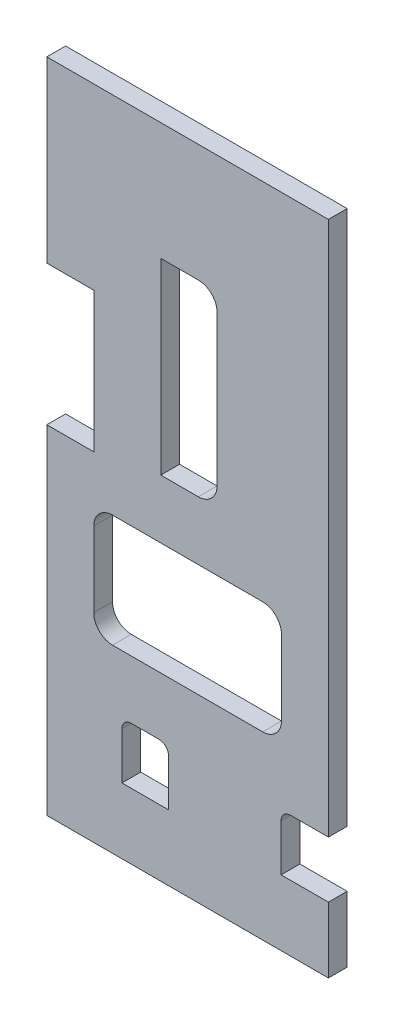
ISO-10303-21;
HEADER;
FILE_DESCRIPTION(('STEP AP214'),'2;1');
FILE_NAME('part.step','',(''),(''),'','','');
FILE_SCHEMA(('AUTOMOTIVE_DESIGN { 1 0 10303 214 1 1 1 1 }'));
ENDSEC;
DATA;
#1=APPLICATION_CONTEXT('core data for automotive mechanical design processes');
#2=APPLICATION_PROTOCOL_DEFINITION('international standard','automotive_design',2000,#1);
#3=PRODUCT_CONTEXT('',#1,'mechanical');
#4=PRODUCT('Part','Part','',(#3));
#5=PRODUCT_RELATED_PRODUCT_CATEGORY('part','',(#4));
#6=PRODUCT_DEFINITION_FORMATION('','',#4);
#7=PRODUCT_DEFINITION_CONTEXT('part definition',#1,'design');
#8=PRODUCT_DEFINITION('design','',#6,#7);
#9=PRODUCT_DEFINITION_SHAPE('','',#8);
#10=(LENGTH_UNIT() NAMED_UNIT(*) SI_UNIT(.MILLI.,.METRE.));
#11=(NAMED_UNIT(*) PLANE_ANGLE_UNIT() SI_UNIT($,.RADIAN.));
#12=(NAMED_UNIT(*) SI_UNIT($,.STERADIAN.) SOLID_ANGLE_UNIT());
#13=UNCERTAINTY_MEASURE_WITH_UNIT(LENGTH_MEASURE(1.E-05),#10,'distance_accuracy_value','');
#14=(GEOMETRIC_REPRESENTATION_CONTEXT(3) GLOBAL_UNCERTAINTY_ASSIGNED_CONTEXT((#13)) GLOBAL_UNIT_ASSIGNED_CONTEXT((#10,
#11,#12)) REPRESENTATION_CONTEXT('',''));
#15=CARTESIAN_POINT('',(0.,0.,0.));
#16=DIRECTION('',(0.,0.,1.));
#17=DIRECTION('',(1.,0.,0.));
#18=AXIS2_PLACEMENT_3D('',#15,#16,#17);
#19=CARTESIAN_POINT('',(95.25,0.,6.35));
#20=DIRECTION('',(-1.,0.,0.));
#21=DIRECTION('',(0.,0.,1.));
#22=AXIS2_PLACEMENT_3D('',#19,#20,#21);
#23=PLANE('',#22);
#24=DIRECTION('',(0.,1.,0.));
#25=VECTOR('',#24,1.);
#26=CARTESIAN_POINT('',(95.25,0.,6.35));
#27=LINE('',#26,#25);
#28=CARTESIAN_POINT('',(95.25,41.2750000000001,6.35));
#29=VERTEX_POINT('',#28);
#30=CARTESIAN_POINT('',(95.25,222.25,6.35));
#31=VERTEX_POINT('',#30);
#32=EDGE_CURVE('E474',#29,#31,#27,.T.);
#33=ORIENTED_EDGE('',*,*,#32,.F.);
#34=DIRECTION('',(0.,0.,-1.));
#35=VECTOR('',#34,1.);
#36=CARTESIAN_POINT('',(95.25,41.2750000000001,6.35));
#37=LINE('',#36,#35);
#38=CARTESIAN_POINT('',(95.25,41.2750000000001,0.));
#39=VERTEX_POINT('',#38);
#40=EDGE_CURVE('E328',#29,#39,#37,.T.);
#41=ORIENTED_EDGE('',*,*,#40,.T.);
#42=DIRECTION('',(0.,1.,0.));
#43=VECTOR('',#42,1.);
#44=CARTESIAN_POINT('',(95.25,0.,0.));
#45=LINE('',#44,#43);
#46=CARTESIAN_POINT('',(95.25,222.25,0.));
#47=VERTEX_POINT('',#46);
#48=EDGE_CURVE('E486',#39,#47,#45,.T.);
#49=ORIENTED_EDGE('',*,*,#48,.T.);
#50=DIRECTION('',(0.,0.,-1.));
#51=VECTOR('',#50,1.);
#52=CARTESIAN_POINT('',(95.25,222.25,6.35));
#53=LINE('',#52,#51);
#54=EDGE_CURVE('E494',#31,#47,#53,.T.);
#55=ORIENTED_EDGE('',*,*,#54,.F.);
#56=EDGE_LOOP('',(#33,#41,#49,#55));
#57=FACE_BOUND('',#56,.T.);
#58=ADVANCED_FACE('F37',(#57),#23,.F.);
#59=CARTESIAN_POINT('',(0.,0.,6.35));
#60=DIRECTION('',(1.,0.,0.));
#61=DIRECTION('',(0.,0.,-1.));
#62=AXIS2_PLACEMENT_3D('',#59,#60,#61);
#63=PLANE('',#62);
#64=DIRECTION('',(0.,-1.,0.));
#65=VECTOR('',#64,1.);
#66=CARTESIAN_POINT('',(0.,0.,0.));
#67=LINE('',#66,#65);
#68=CARTESIAN_POINT('',(0.,222.25,0.));
#69=VERTEX_POINT('',#68);
#70=CARTESIAN_POINT('',(0.,161.812131960124,0.));
#71=VERTEX_POINT('',#70);
#72=EDGE_CURVE('E481',#69,#71,#67,.T.);
#73=ORIENTED_EDGE('',*,*,#72,.T.);
#74=DIRECTION('',(0.,0.,-1.));
#75=VECTOR('',#74,1.);
#76=CARTESIAN_POINT('',(0.,161.812131960124,-4.1785773147932));
#77=LINE('',#76,#75);
#78=CARTESIAN_POINT('',(0.,161.812131960124,6.35));
#79=VERTEX_POINT('',#78);
#80=EDGE_CURVE('E455',#79,#71,#77,.T.);
#81=ORIENTED_EDGE('',*,*,#80,.F.);
#82=DIRECTION('',(0.,-1.,0.));
#83=VECTOR('',#82,1.);
#84=CARTESIAN_POINT('',(0.,0.,6.35));
#85=LINE('',#84,#83);
#86=CARTESIAN_POINT('',(0.,222.25,6.35));
#87=VERTEX_POINT('',#86);
#88=EDGE_CURVE('E468',#87,#79,#85,.T.);
#89=ORIENTED_EDGE('',*,*,#88,.F.);
#90=DIRECTION('',(0.,0.,-1.));
#91=VECTOR('',#90,1.);
#92=CARTESIAN_POINT('',(0.,222.25,6.35));
#93=LINE('',#92,#91);
#94=EDGE_CURVE('E480',#87,#69,#93,.T.);
#95=ORIENTED_EDGE('',*,*,#94,.T.);
#96=EDGE_LOOP('',(#73,#81,#89,#95));
#97=FACE_BOUND('',#96,.T.);
#98=ADVANCED_FACE('F537',(#97),#63,.F.);
#99=CARTESIAN_POINT('',(0.,114.465587535738,6.35));
#100=VERTEX_POINT('',#99);
#101=CARTESIAN_POINT('',(0.,0.,6.35));
#102=VERTEX_POINT('',#101);
#103=EDGE_CURVE('E472',#100,#102,#85,.T.);
#104=ORIENTED_EDGE('',*,*,#103,.F.);
#105=DIRECTION('',(0.,0.,1.));
#106=VECTOR('',#105,1.);
#107=CARTESIAN_POINT('',(0.,114.465587535738,-4.17857731479319));
#108=LINE('',#107,#106);
#109=CARTESIAN_POINT('',(0.,114.465587535738,0.));
#110=VERTEX_POINT('',#109);
#111=EDGE_CURVE('E440',#110,#100,#108,.T.);
#112=ORIENTED_EDGE('',*,*,#111,.F.);
#113=CARTESIAN_POINT('',(0.,0.,0.));
#114=VERTEX_POINT('',#113);
#115=EDGE_CURVE('E467',#110,#114,#67,.T.);
#116=ORIENTED_EDGE('',*,*,#115,.T.);
#117=DIRECTION('',(0.,0.,-1.));
#118=VECTOR('',#117,1.);
#119=CARTESIAN_POINT('',(0.,0.,6.35));
#120=LINE('',#119,#118);
#121=EDGE_CURVE('E500',#102,#114,#120,.T.);
#122=ORIENTED_EDGE('',*,*,#121,.F.);
#123=EDGE_LOOP('',(#104,#112,#116,#122));
#124=FACE_BOUND('',#123,.T.);
#125=ADVANCED_FACE('F39',(#124),#63,.F.);
#126=CARTESIAN_POINT('',(0.,0.,6.35));
#127=DIRECTION('',(0.,1.,0.));
#128=DIRECTION('',(0.,0.,1.));
#129=AXIS2_PLACEMENT_3D('',#126,#127,#128);
#130=PLANE('',#129);
#131=DIRECTION('',(1.,0.,0.));
#132=VECTOR('',#131,1.);
#133=CARTESIAN_POINT('',(0.,0.,0.));
#134=LINE('',#133,#132);
#135=CARTESIAN_POINT('',(95.25,0.,0.));
#136=VERTEX_POINT('',#135);
#137=EDGE_CURVE('E484',#114,#136,#134,.T.);
#138=ORIENTED_EDGE('',*,*,#137,.T.);
#139=DIRECTION('',(0.,0.,-1.));
#140=VECTOR('',#139,1.);
#141=CARTESIAN_POINT('',(95.25,0.,6.35));
#142=LINE('',#141,#140);
#143=CARTESIAN_POINT('',(95.25,0.,6.35));
#144=VERTEX_POINT('',#143);
#145=EDGE_CURVE('E497',#144,#136,#142,.T.);
#146=ORIENTED_EDGE('',*,*,#145,.F.);
#147=DIRECTION('',(1.,0.,0.));
#148=VECTOR('',#147,1.);
#149=CARTESIAN_POINT('',(0.,0.,6.35));
#150=LINE('',#149,#148);
#151=EDGE_CURVE('E471',#102,#144,#150,.T.);
#152=ORIENTED_EDGE('',*,*,#151,.F.);
#153=ORIENTED_EDGE('',*,*,#121,.T.);
#154=EDGE_LOOP('',(#138,#146,#152,#153));
#155=FACE_BOUND('',#154,.T.);
#156=ADVANCED_FACE('F524',(#155),#130,.F.);
#157=CARTESIAN_POINT('',(95.25,22.2250000000001,0.));
#158=VERTEX_POINT('',#157);
#159=EDGE_CURVE('E487',#136,#158,#45,.T.);
#160=ORIENTED_EDGE('',*,*,#159,.T.);
#161=DIRECTION('',(0.,0.,-1.));
#162=VECTOR('',#161,1.);
#163=CARTESIAN_POINT('',(95.25,22.2250000000001,6.35));
#164=LINE('',#163,#162);
#165=CARTESIAN_POINT('',(95.25,22.2250000000001,6.35));
#166=VERTEX_POINT('',#165);
#167=EDGE_CURVE('E318',#166,#158,#164,.T.);
#168=ORIENTED_EDGE('',*,*,#167,.F.);
#169=EDGE_CURVE('E475',#144,#166,#27,.T.);
#170=ORIENTED_EDGE('',*,*,#169,.F.);
#171=ORIENTED_EDGE('',*,*,#145,.T.);
#172=EDGE_LOOP('',(#160,#168,#170,#171));
#173=FACE_BOUND('',#172,.T.);
#174=ADVANCED_FACE('F562',(#173),#23,.F.);
#175=CARTESIAN_POINT('',(0.,222.25,6.35));
#176=DIRECTION('',(0.,-1.,0.));
#177=DIRECTION('',(0.,0.,-1.));
#178=AXIS2_PLACEMENT_3D('',#175,#176,#177);
#179=PLANE('',#178);
#180=DIRECTION('',(-1.,0.,0.));
#181=VECTOR('',#180,1.);
#182=CARTESIAN_POINT('',(0.,222.25,0.));
#183=LINE('',#182,#181);
#184=EDGE_CURVE('E490',#47,#69,#183,.T.);
#185=ORIENTED_EDGE('',*,*,#184,.T.);
#186=ORIENTED_EDGE('',*,*,#94,.F.);
#187=DIRECTION('',(-1.,0.,0.));
#188=VECTOR('',#187,1.);
#189=CARTESIAN_POINT('',(0.,222.25,6.35));
#190=LINE('',#189,#188);
#191=EDGE_CURVE('E478',#31,#87,#190,.T.);
#192=ORIENTED_EDGE('',*,*,#191,.F.);
#193=ORIENTED_EDGE('',*,*,#54,.T.);
#194=EDGE_LOOP('',(#185,#186,#192,#193));
#195=FACE_BOUND('',#194,.T.);
#196=ADVANCED_FACE('F542',(#195),#179,.F.);
#197=CARTESIAN_POINT('',(0.,0.,6.35));
#198=DIRECTION('',(0.,0.,-1.));
#199=DIRECTION('',(-1.,0.,0.));
#200=AXIS2_PLACEMENT_3D('',#197,#198,#199);
#201=PLANE('',#200);
#202=DIRECTION('',(0.,-1.,0.));
#203=VECTOR('',#202,1.);
#204=CARTESIAN_POINT('',(41.148,38.1,6.35));
#205=LINE('',#204,#203);
#206=CARTESIAN_POINT('',(41.148,38.1,6.35));
#207=VERTEX_POINT('',#206);
#208=CARTESIAN_POINT('',(41.148,22.2250000000001,6.35));
#209=VERTEX_POINT('',#208);
#210=EDGE_CURVE('E260',#207,#209,#205,.T.);
#211=ORIENTED_EDGE('',*,*,#210,.T.);
#212=DIRECTION('',(-1.,0.,0.));
#213=VECTOR('',#212,1.);
#214=CARTESIAN_POINT('',(41.148,22.2250000000001,6.35));
#215=LINE('',#214,#213);
#216=CARTESIAN_POINT('',(25.4,22.2250000000001,6.35));
#217=VERTEX_POINT('',#216);
#218=EDGE_CURVE('E254',#209,#217,#215,.T.);
#219=ORIENTED_EDGE('',*,*,#218,.T.);
#220=DIRECTION('',(0.,1.,0.));
#221=VECTOR('',#220,1.);
#222=CARTESIAN_POINT('',(25.4,22.2250000000001,6.35));
#223=LINE('',#222,#221);
#224=CARTESIAN_POINT('',(25.4,38.1,6.35));
#225=VERTEX_POINT('',#224);
#226=EDGE_CURVE('E263',#217,#225,#223,.T.);
#227=ORIENTED_EDGE('',*,*,#226,.T.);
#228=CARTESIAN_POINT('',(28.575,38.1000000000001,6.35));
#229=DIRECTION('',(0.,0.,-1.));
#230=DIRECTION('',(1.,0.,0.));
#231=AXIS2_PLACEMENT_3D('',#228,#229,#230);
#232=CIRCLE('',#231,3.175);
#233=CARTESIAN_POINT('',(28.575,41.2750000000001,6.35));
#234=VERTEX_POINT('',#233);
#235=EDGE_CURVE('E52',#225,#234,#232,.T.);
#236=ORIENTED_EDGE('',*,*,#235,.T.);
#237=DIRECTION('',(1.,0.,0.));
#238=VECTOR('',#237,1.);
#239=CARTESIAN_POINT('',(37.973,41.2750000000001,6.35));
#240=LINE('',#239,#238);
#241=CARTESIAN_POINT('',(37.973,41.2750000000001,6.35));
#242=VERTEX_POINT('',#241);
#243=EDGE_CURVE('E278',#234,#242,#240,.T.);
#244=ORIENTED_EDGE('',*,*,#243,.T.);
#245=CARTESIAN_POINT('',(37.973,38.1000000000001,6.35));
#246=DIRECTION('',(0.,0.,-1.));
#247=DIRECTION('',(-1.,0.,0.));
#248=AXIS2_PLACEMENT_3D('',#245,#246,#247);
#249=CIRCLE('',#248,3.175);
#250=EDGE_CURVE('E281',#242,#207,#249,.T.);
#251=ORIENTED_EDGE('',*,*,#250,.T.);
#252=EDGE_LOOP('',(#211,#219,#227,#236,#244,#251));
#253=FACE_BOUND('',#252,.T.);
#254=DIRECTION('',(-1.,0.,0.));
#255=VECTOR('',#254,1.);
#256=CARTESIAN_POINT('',(73.0249999999999,61.000693086,6.35));
#257=LINE('',#256,#255);
#258=CARTESIAN_POINT('',(73.0249999999999,61.000693086,6.35));
#259=VERTEX_POINT('',#258);
#260=CARTESIAN_POINT('',(22.225,61.000693086,6.35));
#261=VERTEX_POINT('',#260);
#262=EDGE_CURVE('E361',#259,#261,#257,.T.);
#263=ORIENTED_EDGE('',*,*,#262,.T.);
#264=CARTESIAN_POINT('',(22.225,67.350693086,6.35));
#265=DIRECTION('',(0.,0.,-1.));
#266=DIRECTION('',(-1.,0.,0.));
#267=AXIS2_PLACEMENT_3D('',#264,#265,#266);
#268=CIRCLE('',#267,6.35);
#269=CARTESIAN_POINT('',(15.875,67.350693086,6.35));
#270=VERTEX_POINT('',#269);
#271=EDGE_CURVE('E339',#261,#270,#268,.T.);
#272=ORIENTED_EDGE('',*,*,#271,.T.);
#273=DIRECTION('',(0.,1.,0.));
#274=VECTOR('',#273,1.);
#275=CARTESIAN_POINT('',(15.875,92.750693086,6.35));
#276=LINE('',#275,#274);
#277=CARTESIAN_POINT('',(15.875,92.750693086,6.35));
#278=VERTEX_POINT('',#277);
#279=EDGE_CURVE('E342',#270,#278,#276,.T.);
#280=ORIENTED_EDGE('',*,*,#279,.T.);
#281=CARTESIAN_POINT('',(22.225,92.750693086,6.35));
#282=DIRECTION('',(0.,0.,-1.));
#283=DIRECTION('',(1.,0.,0.));
#284=AXIS2_PLACEMENT_3D('',#281,#282,#283);
#285=CIRCLE('',#284,6.35);
#286=CARTESIAN_POINT('',(22.225,99.100693086,6.35));
#287=VERTEX_POINT('',#286);
#288=EDGE_CURVE('E346',#278,#287,#285,.T.);
#289=ORIENTED_EDGE('',*,*,#288,.T.);
#290=DIRECTION('',(1.,0.,0.));
#291=VECTOR('',#290,1.);
#292=CARTESIAN_POINT('',(73.025,99.100693086,6.35));
#293=LINE('',#292,#291);
#294=CARTESIAN_POINT('',(73.025,99.100693086,6.35));
#295=VERTEX_POINT('',#294);
#296=EDGE_CURVE('E349',#287,#295,#293,.T.);
#297=ORIENTED_EDGE('',*,*,#296,.T.);
#298=CARTESIAN_POINT('',(73.025,92.750693086,6.35));
#299=DIRECTION('',(0.,0.,-1.));
#300=DIRECTION('',(-1.,0.,0.));
#301=AXIS2_PLACEMENT_3D('',#298,#299,#300);
#302=CIRCLE('',#301,6.35);
#303=CARTESIAN_POINT('',(79.375,92.750693086,6.35));
#304=VERTEX_POINT('',#303);
#305=EDGE_CURVE('E352',#295,#304,#302,.T.);
#306=ORIENTED_EDGE('',*,*,#305,.T.);
#307=DIRECTION('',(0.,-1.,0.));
#308=VECTOR('',#307,1.);
#309=CARTESIAN_POINT('',(79.375,92.750693086,6.35));
#310=LINE('',#309,#308);
#311=CARTESIAN_POINT('',(79.375,67.350693086,6.35));
#312=VERTEX_POINT('',#311);
#313=EDGE_CURVE('E355',#304,#312,#310,.T.);
#314=ORIENTED_EDGE('',*,*,#313,.T.);
#315=CARTESIAN_POINT('',(73.025,67.350693086,6.35));
#316=DIRECTION('',(0.,0.,-1.));
#317=DIRECTION('',(-1.,0.,0.));
#318=AXIS2_PLACEMENT_3D('',#315,#316,#317);
#319=CIRCLE('',#318,6.35);
#320=EDGE_CURVE('E358',#312,#259,#319,.T.);
#321=ORIENTED_EDGE('',*,*,#320,.T.);
#322=EDGE_LOOP('',(#263,#272,#280,#289,#297,#306,#314,#321));
#323=FACE_BOUND('',#322,.T.);
#324=DIRECTION('',(-1.,0.,0.));
#325=VECTOR('',#324,1.);
#326=CARTESIAN_POINT('',(51.2500000000001,118.983066432882,6.35));
#327=LINE('',#326,#325);
#328=CARTESIAN_POINT('',(51.2500000000001,118.983066432882,6.35));
#329=VERTEX_POINT('',#328);
#330=CARTESIAN_POINT('',(38.5500000000001,118.983066432882,6.35));
#331=VERTEX_POINT('',#330);
#332=EDGE_CURVE('E419',#329,#331,#327,.T.);
#333=ORIENTED_EDGE('',*,*,#332,.T.);
#334=DIRECTION('',(0.,1.,0.));
#335=VECTOR('',#334,1.);
#336=CARTESIAN_POINT('',(38.5500000000001,182.483066432881,6.35));
#337=LINE('',#336,#335);
#338=CARTESIAN_POINT('',(38.5500000000001,182.483066432881,6.35));
#339=VERTEX_POINT('',#338);
#340=EDGE_CURVE('E403',#331,#339,#337,.T.);
#341=ORIENTED_EDGE('',*,*,#340,.T.);
#342=DIRECTION('',(1.,0.,0.));
#343=VECTOR('',#342,1.);
#344=CARTESIAN_POINT('',(51.2500000000001,182.483066432882,6.35));
#345=LINE('',#344,#343);
#346=CARTESIAN_POINT('',(51.2500000000001,182.483066432882,6.35));
#347=VERTEX_POINT('',#346);
#348=EDGE_CURVE('E406',#339,#347,#345,.T.);
#349=ORIENTED_EDGE('',*,*,#348,.T.);
#350=CARTESIAN_POINT('',(51.2500000000001,176.133066432882,6.35));
#351=DIRECTION('',(0.,0.,-1.));
#352=DIRECTION('',(-1.,0.,0.));
#353=AXIS2_PLACEMENT_3D('',#350,#351,#352);
#354=CIRCLE('',#353,6.35);
#355=CARTESIAN_POINT('',(57.6000000000002,176.133066432882,6.35));
#356=VERTEX_POINT('',#355);
#357=EDGE_CURVE('E410',#347,#356,#354,.T.);
#358=ORIENTED_EDGE('',*,*,#357,.T.);
#359=DIRECTION('',(0.,-1.,0.));
#360=VECTOR('',#359,1.);
#361=CARTESIAN_POINT('',(57.6000000000002,176.133066432882,6.35));
#362=LINE('',#361,#360);
#363=CARTESIAN_POINT('',(57.6000000000001,125.333066432881,6.35));
#364=VERTEX_POINT('',#363);
#365=EDGE_CURVE('E413',#356,#364,#362,.T.);
#366=ORIENTED_EDGE('',*,*,#365,.T.);
#367=CARTESIAN_POINT('',(51.2500000000001,125.333066432881,6.35));
#368=DIRECTION('',(0.,0.,-1.));
#369=DIRECTION('',(-1.,0.,0.));
#370=AXIS2_PLACEMENT_3D('',#367,#368,#369);
#371=CIRCLE('',#370,6.35);
#372=EDGE_CURVE('E416',#364,#329,#371,.T.);
#373=ORIENTED_EDGE('',*,*,#372,.T.);
#374=EDGE_LOOP('',(#333,#341,#349,#358,#366,#373));
#375=FACE_BOUND('',#374,.T.);
#376=CARTESIAN_POINT('',(82.423,38.1000000000001,6.35));
#377=DIRECTION('',(0.,0.,-1.));
#378=DIRECTION('',(1.,0.,0.));
#379=AXIS2_PLACEMENT_3D('',#376,#377,#378);
#380=CIRCLE('',#379,3.175);
#381=CARTESIAN_POINT('',(79.248,38.1,6.35));
#382=VERTEX_POINT('',#381);
#383=CARTESIAN_POINT('',(82.423,41.2750000000001,6.35));
#384=VERTEX_POINT('',#383);
#385=EDGE_CURVE('E312',#382,#384,#380,.T.);
#386=ORIENTED_EDGE('',*,*,#385,.T.);
#387=DIRECTION('',(1.,0.,0.));
#388=VECTOR('',#387,1.);
#389=CARTESIAN_POINT('',(95.25,41.2750000000001,6.35));
#390=LINE('',#389,#388);
#391=EDGE_CURVE('E315',#384,#29,#390,.T.);
#392=ORIENTED_EDGE('',*,*,#391,.T.);
#393=ORIENTED_EDGE('',*,*,#32,.T.);
#394=ORIENTED_EDGE('',*,*,#191,.T.);
#395=ORIENTED_EDGE('',*,*,#88,.T.);
#396=DIRECTION('',(1.,0.,0.));
#397=VECTOR('',#396,1.);
#398=CARTESIAN_POINT('',(0.,161.812131960124,6.35));
#399=LINE('',#398,#397);
#400=CARTESIAN_POINT('',(15.875,161.812131960124,6.35));
#401=VERTEX_POINT('',#400);
#402=EDGE_CURVE('E464',#79,#401,#399,.T.);
#403=ORIENTED_EDGE('',*,*,#402,.T.);
#404=DIRECTION('',(0.,1.,0.));
#405=VECTOR('',#404,1.);
#406=CARTESIAN_POINT('',(15.875,0.,6.35));
#407=LINE('',#406,#405);
#408=CARTESIAN_POINT('',(15.875,114.465587535738,6.35));
#409=VERTEX_POINT('',#408);
#410=EDGE_CURVE('E457',#409,#401,#407,.T.);
#411=ORIENTED_EDGE('',*,*,#410,.F.);
#412=DIRECTION('',(-1.,0.,0.));
#413=VECTOR('',#412,1.);
#414=CARTESIAN_POINT('',(0.,114.465587535738,6.35));
#415=LINE('',#414,#413);
#416=EDGE_CURVE('E461',#409,#100,#415,.T.);
#417=ORIENTED_EDGE('',*,*,#416,.T.);
#418=ORIENTED_EDGE('',*,*,#103,.T.);
#419=ORIENTED_EDGE('',*,*,#151,.T.);
#420=ORIENTED_EDGE('',*,*,#169,.T.);
#421=DIRECTION('',(-1.,0.,0.));
#422=VECTOR('',#421,1.);
#423=CARTESIAN_POINT('',(95.25,22.2250000000001,6.35));
#424=LINE('',#423,#422);
#425=CARTESIAN_POINT('',(79.248,22.2250000000001,6.35));
#426=VERTEX_POINT('',#425);
#427=EDGE_CURVE('E305',#166,#426,#424,.T.);
#428=ORIENTED_EDGE('',*,*,#427,.T.);
#429=DIRECTION('',(0.,1.,0.));
#430=VECTOR('',#429,1.);
#431=CARTESIAN_POINT('',(79.248,38.1,6.35));
#432=LINE('',#431,#430);
#433=EDGE_CURVE('E308',#426,#382,#432,.T.);
#434=ORIENTED_EDGE('',*,*,#433,.T.);
#435=EDGE_LOOP('',(#386,#392,#393,#394,#395,#403,#411,#417,#418,#419,#420,#428,#434));
#436=FACE_BOUND('',#435,.T.);
#437=ADVANCED_FACE('F267',(#253,#323,#375,#436),#201,.F.);
#438=CARTESIAN_POINT('',(0.,0.,0.));
#439=DIRECTION('',(0.,0.,-1.));
#440=DIRECTION('',(-1.,0.,0.));
#441=AXIS2_PLACEMENT_3D('',#438,#439,#440);
#442=PLANE('',#441);
#443=DIRECTION('',(-1.,0.,0.));
#444=VECTOR('',#443,1.);
#445=CARTESIAN_POINT('',(41.148,22.2250000000001,0.));
#446=LINE('',#445,#444);
#447=CARTESIAN_POINT('',(41.148,22.2250000000001,0.));
#448=VERTEX_POINT('',#447);
#449=CARTESIAN_POINT('',(25.4,22.2250000000001,0.));
#450=VERTEX_POINT('',#449);
#451=EDGE_CURVE('E60',#448,#450,#446,.T.);
#452=ORIENTED_EDGE('',*,*,#451,.F.);
#453=DIRECTION('',(0.,-1.,0.));
#454=VECTOR('',#453,1.);
#455=CARTESIAN_POINT('',(41.148,38.1,0.));
#456=LINE('',#455,#454);
#457=CARTESIAN_POINT('',(41.148,38.1,0.));
#458=VERTEX_POINT('',#457);
#459=EDGE_CURVE('E271',#458,#448,#456,.T.);
#460=ORIENTED_EDGE('',*,*,#459,.F.);
#461=CARTESIAN_POINT('',(37.973,38.1000000000001,0.));
#462=DIRECTION('',(0.,0.,-1.));
#463=DIRECTION('',(-1.,0.,0.));
#464=AXIS2_PLACEMENT_3D('',#461,#462,#463);
#465=CIRCLE('',#464,3.175);
#466=CARTESIAN_POINT('',(37.973,41.2750000000001,0.));
#467=VERTEX_POINT('',#466);
#468=EDGE_CURVE('E274',#467,#458,#465,.T.);
#469=ORIENTED_EDGE('',*,*,#468,.F.);
#470=DIRECTION('',(1.,0.,0.));
#471=VECTOR('',#470,1.);
#472=CARTESIAN_POINT('',(37.973,41.2750000000001,0.));
#473=LINE('',#472,#471);
#474=CARTESIAN_POINT('',(28.575,41.2750000000001,0.));
#475=VERTEX_POINT('',#474);
#476=EDGE_CURVE('E290',#475,#467,#473,.T.);
#477=ORIENTED_EDGE('',*,*,#476,.F.);
#478=CARTESIAN_POINT('',(28.575,38.1000000000001,0.));
#479=DIRECTION('',(0.,0.,-1.));
#480=DIRECTION('',(1.,0.,0.));
#481=AXIS2_PLACEMENT_3D('',#478,#479,#480);
#482=CIRCLE('',#481,3.175);
#483=CARTESIAN_POINT('',(25.4,38.1,0.));
#484=VERTEX_POINT('',#483);
#485=EDGE_CURVE('E287',#484,#475,#482,.T.);
#486=ORIENTED_EDGE('',*,*,#485,.F.);
#487=DIRECTION('',(0.,1.,0.));
#488=VECTOR('',#487,1.);
#489=CARTESIAN_POINT('',(25.4,22.2250000000001,0.));
#490=LINE('',#489,#488);
#491=EDGE_CURVE('E285',#450,#484,#490,.T.);
#492=ORIENTED_EDGE('',*,*,#491,.F.);
#493=EDGE_LOOP('',(#452,#460,#469,#477,#486,#492));
#494=FACE_BOUND('',#493,.T.);
#495=DIRECTION('',(1.,0.,0.));
#496=VECTOR('',#495,1.);
#497=CARTESIAN_POINT('',(95.25,41.2750000000001,0.));
#498=LINE('',#497,#496);
#499=CARTESIAN_POINT('',(82.423,41.2750000000001,0.));
#500=VERTEX_POINT('',#499);
#501=EDGE_CURVE('E309',#500,#39,#498,.T.);
#502=ORIENTED_EDGE('',*,*,#501,.F.);
#503=CARTESIAN_POINT('',(82.423,38.1000000000001,0.));
#504=DIRECTION('',(0.,0.,-1.));
#505=DIRECTION('',(1.,0.,0.));
#506=AXIS2_PLACEMENT_3D('',#503,#504,#505);
#507=CIRCLE('',#506,3.175);
#508=CARTESIAN_POINT('',(79.248,38.1,0.));
#509=VERTEX_POINT('',#508);
#510=EDGE_CURVE('E324',#509,#500,#507,.T.);
#511=ORIENTED_EDGE('',*,*,#510,.F.);
#512=DIRECTION('',(0.,1.,0.));
#513=VECTOR('',#512,1.);
#514=CARTESIAN_POINT('',(79.248,38.1,0.));
#515=LINE('',#514,#513);
#516=CARTESIAN_POINT('',(79.248,22.2250000000001,0.));
#517=VERTEX_POINT('',#516);
#518=EDGE_CURVE('E321',#517,#509,#515,.T.);
#519=ORIENTED_EDGE('',*,*,#518,.F.);
#520=DIRECTION('',(-1.,0.,0.));
#521=VECTOR('',#520,1.);
#522=CARTESIAN_POINT('',(95.25,22.2250000000001,0.));
#523=LINE('',#522,#521);
#524=EDGE_CURVE('E297',#158,#517,#523,.T.);
#525=ORIENTED_EDGE('',*,*,#524,.F.);
#526=ORIENTED_EDGE('',*,*,#159,.F.);
#527=ORIENTED_EDGE('',*,*,#137,.F.);
#528=ORIENTED_EDGE('',*,*,#115,.F.);
#529=DIRECTION('',(-1.,0.,0.));
#530=VECTOR('',#529,1.);
#531=CARTESIAN_POINT('',(0.,114.465587535738,0.));
#532=LINE('',#531,#530);
#533=CARTESIAN_POINT('',(15.875,114.465587535738,0.));
#534=VERTEX_POINT('',#533);
#535=EDGE_CURVE('E45',#534,#110,#532,.T.);
#536=ORIENTED_EDGE('',*,*,#535,.F.);
#537=DIRECTION('',(0.,1.,0.));
#538=VECTOR('',#537,1.);
#539=CARTESIAN_POINT('',(15.875,0.,0.));
#540=LINE('',#539,#538);
#541=CARTESIAN_POINT('',(15.875,161.812131960124,0.));
#542=VERTEX_POINT('',#541);
#543=EDGE_CURVE('E503',#534,#542,#540,.T.);
#544=ORIENTED_EDGE('',*,*,#543,.T.);
#545=DIRECTION('',(1.,0.,0.));
#546=VECTOR('',#545,1.);
#547=CARTESIAN_POINT('',(0.,161.812131960124,0.));
#548=LINE('',#547,#546);
#549=EDGE_CURVE('E11',#71,#542,#548,.T.);
#550=ORIENTED_EDGE('',*,*,#549,.F.);
#551=ORIENTED_EDGE('',*,*,#72,.F.);
#552=ORIENTED_EDGE('',*,*,#184,.F.);
#553=ORIENTED_EDGE('',*,*,#48,.F.);
#554=EDGE_LOOP('',(#502,#511,#519,#525,#526,#527,#528,#536,#544,#550,#551,#552,#553));
#555=FACE_BOUND('',#554,.T.);
#556=CARTESIAN_POINT('',(22.225,67.350693086,0.));
#557=DIRECTION('',(0.,0.,-1.));
#558=DIRECTION('',(-1.,0.,0.));
#559=AXIS2_PLACEMENT_3D('',#556,#557,#558);
#560=CIRCLE('',#559,6.35);
#561=CARTESIAN_POINT('',(22.225,61.000693086,0.));
#562=VERTEX_POINT('',#561);
#563=CARTESIAN_POINT('',(15.875,67.350693086,0.));
#564=VERTEX_POINT('',#563);
#565=EDGE_CURVE('E331',#562,#564,#560,.T.);
#566=ORIENTED_EDGE('',*,*,#565,.F.);
#567=DIRECTION('',(-1.,0.,0.));
#568=VECTOR('',#567,1.);
#569=CARTESIAN_POINT('',(73.0249999999999,61.000693086,0.));
#570=LINE('',#569,#568);
#571=CARTESIAN_POINT('',(73.0249999999999,61.000693086,0.));
#572=VERTEX_POINT('',#571);
#573=EDGE_CURVE('E343',#572,#562,#570,.T.);
#574=ORIENTED_EDGE('',*,*,#573,.F.);
#575=CARTESIAN_POINT('',(73.025,67.350693086,0.));
#576=DIRECTION('',(0.,0.,-1.));
#577=DIRECTION('',(-1.,0.,0.));
#578=AXIS2_PLACEMENT_3D('',#575,#576,#577);
#579=CIRCLE('',#578,6.35);
#580=CARTESIAN_POINT('',(79.375,67.350693086,0.));
#581=VERTEX_POINT('',#580);
#582=EDGE_CURVE('E381',#581,#572,#579,.T.);
#583=ORIENTED_EDGE('',*,*,#582,.F.);
#584=DIRECTION('',(0.,-1.,0.));
#585=VECTOR('',#584,1.);
#586=CARTESIAN_POINT('',(79.375,92.750693086,0.));
#587=LINE('',#586,#585);
#588=CARTESIAN_POINT('',(79.375,92.750693086,0.));
#589=VERTEX_POINT('',#588);
#590=EDGE_CURVE('E378',#589,#581,#587,.T.);
#591=ORIENTED_EDGE('',*,*,#590,.F.);
#592=CARTESIAN_POINT('',(73.025,92.750693086,0.));
#593=DIRECTION('',(0.,0.,-1.));
#594=DIRECTION('',(-1.,0.,0.));
#595=AXIS2_PLACEMENT_3D('',#592,#593,#594);
#596=CIRCLE('',#595,6.35);
#597=CARTESIAN_POINT('',(73.025,99.100693086,0.));
#598=VERTEX_POINT('',#597);
#599=EDGE_CURVE('E375',#598,#589,#596,.T.);
#600=ORIENTED_EDGE('',*,*,#599,.F.);
#601=DIRECTION('',(1.,0.,0.));
#602=VECTOR('',#601,1.);
#603=CARTESIAN_POINT('',(73.025,99.100693086,0.));
#604=LINE('',#603,#602);
#605=CARTESIAN_POINT('',(22.225,99.100693086,0.));
#606=VERTEX_POINT('',#605);
#607=EDGE_CURVE('E372',#606,#598,#604,.T.);
#608=ORIENTED_EDGE('',*,*,#607,.F.);
#609=CARTESIAN_POINT('',(22.225,92.750693086,0.));
#610=DIRECTION('',(0.,0.,-1.));
#611=DIRECTION('',(1.,0.,0.));
#612=AXIS2_PLACEMENT_3D('',#609,#610,#611);
#613=CIRCLE('',#612,6.35);
#614=CARTESIAN_POINT('',(15.875,92.750693086,0.));
#615=VERTEX_POINT('',#614);
#616=EDGE_CURVE('E369',#615,#606,#613,.T.);
#617=ORIENTED_EDGE('',*,*,#616,.F.);
#618=DIRECTION('',(0.,1.,0.));
#619=VECTOR('',#618,1.);
#620=CARTESIAN_POINT('',(15.875,92.750693086,0.));
#621=LINE('',#620,#619);
#622=EDGE_CURVE('E366',#564,#615,#621,.T.);
#623=ORIENTED_EDGE('',*,*,#622,.F.);
#624=EDGE_LOOP('',(#566,#574,#583,#591,#600,#608,#617,#623));
#625=FACE_BOUND('',#624,.T.);
#626=DIRECTION('',(0.,1.,0.));
#627=VECTOR('',#626,1.);
#628=CARTESIAN_POINT('',(38.5500000000001,182.483066432881,0.));
#629=LINE('',#628,#627);
#630=CARTESIAN_POINT('',(38.5500000000001,118.983066432882,0.));
#631=VERTEX_POINT('',#630);
#632=CARTESIAN_POINT('',(38.5500000000001,182.483066432881,0.));
#633=VERTEX_POINT('',#632);
#634=EDGE_CURVE('E388',#631,#633,#629,.T.);
#635=ORIENTED_EDGE('',*,*,#634,.F.);
#636=DIRECTION('',(-1.,0.,0.));
#637=VECTOR('',#636,1.);
#638=CARTESIAN_POINT('',(51.2500000000001,118.983066432882,0.));
#639=LINE('',#638,#637);
#640=CARTESIAN_POINT('',(51.2500000000001,118.983066432882,0.));
#641=VERTEX_POINT('',#640);
#642=EDGE_CURVE('E407',#641,#631,#639,.T.);
#643=ORIENTED_EDGE('',*,*,#642,.F.);
#644=CARTESIAN_POINT('',(51.2500000000001,125.333066432881,0.));
#645=DIRECTION('',(0.,0.,-1.));
#646=DIRECTION('',(-1.,0.,0.));
#647=AXIS2_PLACEMENT_3D('',#644,#645,#646);
#648=CIRCLE('',#647,6.35);
#649=CARTESIAN_POINT('',(57.6000000000001,125.333066432881,0.));
#650=VERTEX_POINT('',#649);
#651=EDGE_CURVE('E433',#650,#641,#648,.T.);
#652=ORIENTED_EDGE('',*,*,#651,.F.);
#653=DIRECTION('',(0.,-1.,0.));
#654=VECTOR('',#653,1.);
#655=CARTESIAN_POINT('',(57.6000000000002,176.133066432882,0.));
#656=LINE('',#655,#654);
#657=CARTESIAN_POINT('',(57.6000000000002,176.133066432882,0.));
#658=VERTEX_POINT('',#657);
#659=EDGE_CURVE('E430',#658,#650,#656,.T.);
#660=ORIENTED_EDGE('',*,*,#659,.F.);
#661=CARTESIAN_POINT('',(51.2500000000001,176.133066432882,0.));
#662=DIRECTION('',(0.,0.,-1.));
#663=DIRECTION('',(-1.,0.,0.));
#664=AXIS2_PLACEMENT_3D('',#661,#662,#663);
#665=CIRCLE('',#664,6.35);
#666=CARTESIAN_POINT('',(51.2500000000001,182.483066432882,0.));
#667=VERTEX_POINT('',#666);
#668=EDGE_CURVE('E427',#667,#658,#665,.T.);
#669=ORIENTED_EDGE('',*,*,#668,.F.);
#670=DIRECTION('',(1.,0.,0.));
#671=VECTOR('',#670,1.);
#672=CARTESIAN_POINT('',(51.2500000000001,182.483066432882,0.));
#673=LINE('',#672,#671);
#674=EDGE_CURVE('E424',#633,#667,#673,.T.);
#675=ORIENTED_EDGE('',*,*,#674,.F.);
#676=EDGE_LOOP('',(#635,#643,#652,#660,#669,#675));
#677=FACE_BOUND('',#676,.T.);
#678=ADVANCED_FACE('F517',(#494,#555,#625,#677),#442,.T.);
#679=CARTESIAN_POINT('',(15.875,161.812131960124,-4.1785773147932));
#680=DIRECTION('',(0.,1.,0.));
#681=DIRECTION('',(0.,0.,1.));
#682=AXIS2_PLACEMENT_3D('',#679,#680,#681);
#683=PLANE('',#682);
#684=ORIENTED_EDGE('',*,*,#80,.T.);
#685=ORIENTED_EDGE('',*,*,#549,.T.);
#686=DIRECTION('',(0.,0.,-1.));
#687=VECTOR('',#686,1.);
#688=CARTESIAN_POINT('',(15.875,161.812131960124,-4.1785773147932));
#689=LINE('',#688,#687);
#690=EDGE_CURVE('E454',#401,#542,#689,.T.);
#691=ORIENTED_EDGE('',*,*,#690,.F.);
#692=ORIENTED_EDGE('',*,*,#402,.F.);
#693=EDGE_LOOP('',(#684,#685,#691,#692));
#694=FACE_BOUND('',#693,.T.);
#695=ADVANCED_FACE('F585',(#694),#683,.F.);
#696=CARTESIAN_POINT('',(15.875,114.465587535738,-4.17857731479319));
#697=DIRECTION('',(0.,-1.,0.));
#698=DIRECTION('',(0.,0.,-1.));
#699=AXIS2_PLACEMENT_3D('',#696,#697,#698);
#700=PLANE('',#699);
#701=DIRECTION('',(0.,0.,1.));
#702=VECTOR('',#701,1.);
#703=CARTESIAN_POINT('',(15.875,114.465587535738,-4.17857731479319));
#704=LINE('',#703,#702);
#705=EDGE_CURVE('E451',#534,#409,#704,.T.);
#706=ORIENTED_EDGE('',*,*,#705,.F.);
#707=ORIENTED_EDGE('',*,*,#535,.T.);
#708=ORIENTED_EDGE('',*,*,#111,.T.);
#709=ORIENTED_EDGE('',*,*,#416,.F.);
#710=EDGE_LOOP('',(#706,#707,#708,#709));
#711=FACE_BOUND('',#710,.T.);
#712=ADVANCED_FACE('F509',(#711),#700,.F.);
#713=CARTESIAN_POINT('',(15.875,0.,0.));
#714=DIRECTION('',(-1.,0.,0.));
#715=DIRECTION('',(0.,0.,1.));
#716=AXIS2_PLACEMENT_3D('',#713,#714,#715);
#717=PLANE('',#716);
#718=ORIENTED_EDGE('',*,*,#410,.T.);
#719=ORIENTED_EDGE('',*,*,#690,.T.);
#720=ORIENTED_EDGE('',*,*,#543,.F.);
#721=ORIENTED_EDGE('',*,*,#705,.T.);
#722=EDGE_LOOP('',(#718,#719,#720,#721));
#723=FACE_BOUND('',#722,.T.);
#724=ADVANCED_FACE('F529',(#723),#717,.T.);
#725=CARTESIAN_POINT('',(38.5500000000001,182.483066432881,6.35));
#726=DIRECTION('',(-1.,0.,0.));
#727=DIRECTION('',(0.,-1.,0.));
#728=AXIS2_PLACEMENT_3D('',#725,#726,#727);
#729=PLANE('',#728);
#730=ORIENTED_EDGE('',*,*,#634,.T.);
#731=DIRECTION('',(0.,0.,-1.));
#732=VECTOR('',#731,1.);
#733=CARTESIAN_POINT('',(38.5500000000001,182.483066432881,6.35));
#734=LINE('',#733,#732);
#735=EDGE_CURVE('E422',#339,#633,#734,.T.);
#736=ORIENTED_EDGE('',*,*,#735,.F.);
#737=ORIENTED_EDGE('',*,*,#340,.F.);
#738=DIRECTION('',(0.,0.,-1.));
#739=VECTOR('',#738,1.);
#740=CARTESIAN_POINT('',(38.5500000000001,118.983066432882,6.35));
#741=LINE('',#740,#739);
#742=EDGE_CURVE('E438',#331,#631,#741,.T.);
#743=ORIENTED_EDGE('',*,*,#742,.T.);
#744=EDGE_LOOP('',(#730,#736,#737,#743));
#745=FACE_BOUND('',#744,.T.);
#746=ADVANCED_FACE('F607',(#745),#729,.F.);
#747=CARTESIAN_POINT('',(51.2500000000001,118.983066432882,6.35));
#748=DIRECTION('',(0.,-1.,0.));
#749=DIRECTION('',(0.,0.,-1.));
#750=AXIS2_PLACEMENT_3D('',#747,#748,#749);
#751=PLANE('',#750);
#752=ORIENTED_EDGE('',*,*,#642,.T.);
#753=ORIENTED_EDGE('',*,*,#742,.F.);
#754=ORIENTED_EDGE('',*,*,#332,.F.);
#755=DIRECTION('',(0.,0.,-1.));
#756=VECTOR('',#755,1.);
#757=CARTESIAN_POINT('',(51.2500000000001,118.983066432882,6.35));
#758=LINE('',#757,#756);
#759=EDGE_CURVE('E441',#329,#641,#758,.T.);
#760=ORIENTED_EDGE('',*,*,#759,.T.);
#761=EDGE_LOOP('',(#752,#753,#754,#760));
#762=FACE_BOUND('',#761,.T.);
#763=ADVANCED_FACE('F616',(#762),#751,.F.);
#764=CARTESIAN_POINT('',(51.2500000000001,125.333066432881,6.35));
#765=DIRECTION('',(0.,0.,-1.));
#766=DIRECTION('',(-1.,0.,0.));
#767=AXIS2_PLACEMENT_3D('',#764,#765,#766);
#768=CYLINDRICAL_SURFACE('',#767,6.35);
#769=ORIENTED_EDGE('',*,*,#651,.T.);
#770=ORIENTED_EDGE('',*,*,#759,.F.);
#771=ORIENTED_EDGE('',*,*,#372,.F.);
#772=DIRECTION('',(0.,0.,-1.));
#773=VECTOR('',#772,1.);
#774=CARTESIAN_POINT('',(57.6000000000001,125.333066432881,6.35));
#775=LINE('',#774,#773);
#776=EDGE_CURVE('E443',#364,#650,#775,.T.);
#777=ORIENTED_EDGE('',*,*,#776,.T.);
#778=EDGE_LOOP('',(#769,#770,#771,#777));
#779=FACE_BOUND('',#778,.T.);
#780=ADVANCED_FACE('F626',(#779),#768,.F.);
#781=CARTESIAN_POINT('',(57.6000000000002,176.133066432882,6.35));
#782=DIRECTION('',(1.,0.,0.));
#783=DIRECTION('',(0.,0.,-1.));
#784=AXIS2_PLACEMENT_3D('',#781,#782,#783);
#785=PLANE('',#784);
#786=ORIENTED_EDGE('',*,*,#659,.T.);
#787=ORIENTED_EDGE('',*,*,#776,.F.);
#788=ORIENTED_EDGE('',*,*,#365,.F.);
#789=DIRECTION('',(0.,0.,-1.));
#790=VECTOR('',#789,1.);
#791=CARTESIAN_POINT('',(57.6000000000002,176.133066432882,6.35));
#792=LINE('',#791,#790);
#793=EDGE_CURVE('E445',#356,#658,#792,.T.);
#794=ORIENTED_EDGE('',*,*,#793,.T.);
#795=EDGE_LOOP('',(#786,#787,#788,#794));
#796=FACE_BOUND('',#795,.T.);
#797=ADVANCED_FACE('F636',(#796),#785,.F.);
#798=CARTESIAN_POINT('',(51.2500000000001,176.133066432882,6.35));
#799=DIRECTION('',(0.,0.,-1.));
#800=DIRECTION('',(-1.,0.,0.));
#801=AXIS2_PLACEMENT_3D('',#798,#799,#800);
#802=CYLINDRICAL_SURFACE('',#801,6.35);
#803=ORIENTED_EDGE('',*,*,#668,.T.);
#804=ORIENTED_EDGE('',*,*,#793,.F.);
#805=ORIENTED_EDGE('',*,*,#357,.F.);
#806=DIRECTION('',(0.,0.,-1.));
#807=VECTOR('',#806,1.);
#808=CARTESIAN_POINT('',(51.2500000000001,182.483066432882,6.35));
#809=LINE('',#808,#807);
#810=EDGE_CURVE('E447',#347,#667,#809,.T.);
#811=ORIENTED_EDGE('',*,*,#810,.T.);
#812=EDGE_LOOP('',(#803,#804,#805,#811));
#813=FACE_BOUND('',#812,.T.);
#814=ADVANCED_FACE('F646',(#813),#802,.F.);
#815=CARTESIAN_POINT('',(51.2500000000001,182.483066432882,6.35));
#816=DIRECTION('',(0.,1.,0.));
#817=DIRECTION('',(-1.,0.,0.));
#818=AXIS2_PLACEMENT_3D('',#815,#816,#817);
#819=PLANE('',#818);
#820=ORIENTED_EDGE('',*,*,#674,.T.);
#821=ORIENTED_EDGE('',*,*,#810,.F.);
#822=ORIENTED_EDGE('',*,*,#348,.F.);
#823=ORIENTED_EDGE('',*,*,#735,.T.);
#824=EDGE_LOOP('',(#820,#821,#822,#823));
#825=FACE_BOUND('',#824,.T.);
#826=ADVANCED_FACE('F656',(#825),#819,.F.);
#827=CARTESIAN_POINT('',(22.225,67.350693086,6.35));
#828=DIRECTION('',(0.,0.,-1.));
#829=DIRECTION('',(-1.,0.,0.));
#830=AXIS2_PLACEMENT_3D('',#827,#828,#829);
#831=CYLINDRICAL_SURFACE('',#830,6.35);
#832=ORIENTED_EDGE('',*,*,#565,.T.);
#833=DIRECTION('',(0.,0.,-1.));
#834=VECTOR('',#833,1.);
#835=CARTESIAN_POINT('',(15.875,67.350693086,6.35));
#836=LINE('',#835,#834);
#837=EDGE_CURVE('E364',#270,#564,#836,.T.);
#838=ORIENTED_EDGE('',*,*,#837,.F.);
#839=ORIENTED_EDGE('',*,*,#271,.F.);
#840=DIRECTION('',(0.,0.,-1.));
#841=VECTOR('',#840,1.);
#842=CARTESIAN_POINT('',(22.225,61.000693086,6.35));
#843=LINE('',#842,#841);
#844=EDGE_CURVE('E386',#261,#562,#843,.T.);
#845=ORIENTED_EDGE('',*,*,#844,.T.);
#846=EDGE_LOOP('',(#832,#838,#839,#845));
#847=FACE_BOUND('',#846,.T.);
#848=ADVANCED_FACE('F666',(#847),#831,.F.);
#849=CARTESIAN_POINT('',(73.0249999999999,61.000693086,6.35));
#850=DIRECTION('',(0.,-1.,0.));
#851=DIRECTION('',(0.,0.,-1.));
#852=AXIS2_PLACEMENT_3D('',#849,#850,#851);
#853=PLANE('',#852);
#854=ORIENTED_EDGE('',*,*,#573,.T.);
#855=ORIENTED_EDGE('',*,*,#844,.F.);
#856=ORIENTED_EDGE('',*,*,#262,.F.);
#857=DIRECTION('',(0.,0.,-1.));
#858=VECTOR('',#857,1.);
#859=CARTESIAN_POINT('',(73.0249999999999,61.000693086,6.35));
#860=LINE('',#859,#858);
#861=EDGE_CURVE('E389',#259,#572,#860,.T.);
#862=ORIENTED_EDGE('',*,*,#861,.T.);
#863=EDGE_LOOP('',(#854,#855,#856,#862));
#864=FACE_BOUND('',#863,.T.);
#865=ADVANCED_FACE('F676',(#864),#853,.F.);
#866=CARTESIAN_POINT('',(73.025,67.350693086,6.35));
#867=DIRECTION('',(0.,0.,-1.));
#868=DIRECTION('',(-1.,0.,0.));
#869=AXIS2_PLACEMENT_3D('',#866,#867,#868);
#870=CYLINDRICAL_SURFACE('',#869,6.35);
#871=ORIENTED_EDGE('',*,*,#582,.T.);
#872=ORIENTED_EDGE('',*,*,#861,.F.);
#873=ORIENTED_EDGE('',*,*,#320,.F.);
#874=DIRECTION('',(0.,0.,-1.));
#875=VECTOR('',#874,1.);
#876=CARTESIAN_POINT('',(79.375,67.350693086,6.35));
#877=LINE('',#876,#875);
#878=EDGE_CURVE('E391',#312,#581,#877,.T.);
#879=ORIENTED_EDGE('',*,*,#878,.T.);
#880=EDGE_LOOP('',(#871,#872,#873,#879));
#881=FACE_BOUND('',#880,.T.);
#882=ADVANCED_FACE('F686',(#881),#870,.F.);
#883=CARTESIAN_POINT('',(79.375,92.750693086,6.35));
#884=DIRECTION('',(1.,0.,0.));
#885=DIRECTION('',(0.,1.,0.));
#886=AXIS2_PLACEMENT_3D('',#883,#884,#885);
#887=PLANE('',#886);
#888=ORIENTED_EDGE('',*,*,#590,.T.);
#889=ORIENTED_EDGE('',*,*,#878,.F.);
#890=ORIENTED_EDGE('',*,*,#313,.F.);
#891=DIRECTION('',(0.,0.,-1.));
#892=VECTOR('',#891,1.);
#893=CARTESIAN_POINT('',(79.375,92.750693086,6.35));
#894=LINE('',#893,#892);
#895=EDGE_CURVE('E393',#304,#589,#894,.T.);
#896=ORIENTED_EDGE('',*,*,#895,.T.);
#897=EDGE_LOOP('',(#888,#889,#890,#896));
#898=FACE_BOUND('',#897,.T.);
#899=ADVANCED_FACE('F696',(#898),#887,.F.);
#900=CARTESIAN_POINT('',(73.025,92.750693086,6.35));
#901=DIRECTION('',(0.,0.,-1.));
#902=DIRECTION('',(-1.,0.,0.));
#903=AXIS2_PLACEMENT_3D('',#900,#901,#902);
#904=CYLINDRICAL_SURFACE('',#903,6.35);
#905=ORIENTED_EDGE('',*,*,#599,.T.);
#906=ORIENTED_EDGE('',*,*,#895,.F.);
#907=ORIENTED_EDGE('',*,*,#305,.F.);
#908=DIRECTION('',(0.,0.,-1.));
#909=VECTOR('',#908,1.);
#910=CARTESIAN_POINT('',(73.025,99.100693086,6.35));
#911=LINE('',#910,#909);
#912=EDGE_CURVE('E395',#295,#598,#911,.T.);
#913=ORIENTED_EDGE('',*,*,#912,.T.);
#914=EDGE_LOOP('',(#905,#906,#907,#913));
#915=FACE_BOUND('',#914,.T.);
#916=ADVANCED_FACE('F706',(#915),#904,.F.);
#917=CARTESIAN_POINT('',(73.025,99.100693086,6.35));
#918=DIRECTION('',(0.,1.,0.));
#919=DIRECTION('',(0.,0.,1.));
#920=AXIS2_PLACEMENT_3D('',#917,#918,#919);
#921=PLANE('',#920);
#922=ORIENTED_EDGE('',*,*,#607,.T.);
#923=ORIENTED_EDGE('',*,*,#912,.F.);
#924=ORIENTED_EDGE('',*,*,#296,.F.);
#925=DIRECTION('',(0.,0.,-1.));
#926=VECTOR('',#925,1.);
#927=CARTESIAN_POINT('',(22.225,99.100693086,6.35));
#928=LINE('',#927,#926);
#929=EDGE_CURVE('E397',#287,#606,#928,.T.);
#930=ORIENTED_EDGE('',*,*,#929,.T.);
#931=EDGE_LOOP('',(#922,#923,#924,#930));
#932=FACE_BOUND('',#931,.T.);
#933=ADVANCED_FACE('F716',(#932),#921,.F.);
#934=CARTESIAN_POINT('',(22.225,92.750693086,6.35));
#935=DIRECTION('',(0.,0.,-1.));
#936=DIRECTION('',(-1.,0.,0.));
#937=AXIS2_PLACEMENT_3D('',#934,#935,#936);
#938=CYLINDRICAL_SURFACE('',#937,6.35);
#939=ORIENTED_EDGE('',*,*,#616,.T.);
#940=ORIENTED_EDGE('',*,*,#929,.F.);
#941=ORIENTED_EDGE('',*,*,#288,.F.);
#942=DIRECTION('',(0.,0.,-1.));
#943=VECTOR('',#942,1.);
#944=CARTESIAN_POINT('',(15.875,92.750693086,6.35));
#945=LINE('',#944,#943);
#946=EDGE_CURVE('E399',#278,#615,#945,.T.);
#947=ORIENTED_EDGE('',*,*,#946,.T.);
#948=EDGE_LOOP('',(#939,#940,#941,#947));
#949=FACE_BOUND('',#948,.T.);
#950=ADVANCED_FACE('F726',(#949),#938,.F.);
#951=CARTESIAN_POINT('',(15.875,92.750693086,6.35));
#952=DIRECTION('',(-1.,0.,0.));
#953=DIRECTION('',(0.,-1.,0.));
#954=AXIS2_PLACEMENT_3D('',#951,#952,#953);
#955=PLANE('',#954);
#956=ORIENTED_EDGE('',*,*,#622,.T.);
#957=ORIENTED_EDGE('',*,*,#946,.F.);
#958=ORIENTED_EDGE('',*,*,#279,.F.);
#959=ORIENTED_EDGE('',*,*,#837,.T.);
#960=EDGE_LOOP('',(#956,#957,#958,#959));
#961=FACE_BOUND('',#960,.T.);
#962=ADVANCED_FACE('F735',(#961),#955,.F.);
#963=CARTESIAN_POINT('',(95.25,41.2750000000001,6.35));
#964=DIRECTION('',(0.,1.,0.));
#965=DIRECTION('',(0.,0.,1.));
#966=AXIS2_PLACEMENT_3D('',#963,#964,#965);
#967=PLANE('',#966);
#968=ORIENTED_EDGE('',*,*,#501,.T.);
#969=ORIENTED_EDGE('',*,*,#40,.F.);
#970=ORIENTED_EDGE('',*,*,#391,.F.);
#971=DIRECTION('',(0.,0.,-1.));
#972=VECTOR('',#971,1.);
#973=CARTESIAN_POINT('',(82.423,41.2750000000001,6.35));
#974=LINE('',#973,#972);
#975=EDGE_CURVE('E332',#384,#500,#974,.T.);
#976=ORIENTED_EDGE('',*,*,#975,.T.);
#977=EDGE_LOOP('',(#968,#969,#970,#976));
#978=FACE_BOUND('',#977,.T.);
#979=ADVANCED_FACE('F550',(#978),#967,.F.);
#980=CARTESIAN_POINT('',(82.423,38.1000000000001,6.35));
#981=DIRECTION('',(0.,0.,-1.));
#982=DIRECTION('',(-1.,0.,0.));
#983=AXIS2_PLACEMENT_3D('',#980,#981,#982);
#984=CYLINDRICAL_SURFACE('',#983,3.175);
#985=ORIENTED_EDGE('',*,*,#510,.T.);
#986=ORIENTED_EDGE('',*,*,#975,.F.);
#987=ORIENTED_EDGE('',*,*,#385,.F.);
#988=DIRECTION('',(0.,0.,-1.));
#989=VECTOR('',#988,1.);
#990=CARTESIAN_POINT('',(79.248,38.1,6.35));
#991=LINE('',#990,#989);
#992=EDGE_CURVE('E334',#382,#509,#991,.T.);
#993=ORIENTED_EDGE('',*,*,#992,.T.);
#994=EDGE_LOOP('',(#985,#986,#987,#993));
#995=FACE_BOUND('',#994,.T.);
#996=ADVANCED_FACE('F554',(#995),#984,.F.);
#997=CARTESIAN_POINT('',(79.248,38.1,6.35));
#998=DIRECTION('',(-1.,0.,0.));
#999=DIRECTION('',(0.,0.,1.));
#1000=AXIS2_PLACEMENT_3D('',#997,#998,#999);
#1001=PLANE('',#1000);
#1002=ORIENTED_EDGE('',*,*,#518,.T.);
#1003=ORIENTED_EDGE('',*,*,#992,.F.);
#1004=ORIENTED_EDGE('',*,*,#433,.F.);
#1005=DIRECTION('',(0.,0.,-1.));
#1006=VECTOR('',#1005,1.);
#1007=CARTESIAN_POINT('',(79.248,22.2250000000001,6.35));
#1008=LINE('',#1007,#1006);
#1009=EDGE_CURVE('E336',#426,#517,#1008,.T.);
#1010=ORIENTED_EDGE('',*,*,#1009,.T.);
#1011=EDGE_LOOP('',(#1002,#1003,#1004,#1010));
#1012=FACE_BOUND('',#1011,.T.);
#1013=ADVANCED_FACE('F557',(#1012),#1001,.F.);
#1014=CARTESIAN_POINT('',(95.25,22.2250000000001,6.35));
#1015=DIRECTION('',(0.,-1.,0.));
#1016=DIRECTION('',(0.,0.,-1.));
#1017=AXIS2_PLACEMENT_3D('',#1014,#1015,#1016);
#1018=PLANE('',#1017);
#1019=ORIENTED_EDGE('',*,*,#524,.T.);
#1020=ORIENTED_EDGE('',*,*,#1009,.F.);
#1021=ORIENTED_EDGE('',*,*,#427,.F.);
#1022=ORIENTED_EDGE('',*,*,#167,.T.);
#1023=EDGE_LOOP('',(#1019,#1020,#1021,#1022));
#1024=FACE_BOUND('',#1023,.T.);
#1025=ADVANCED_FACE('F559',(#1024),#1018,.F.);
#1026=CARTESIAN_POINT('',(41.148,22.2250000000001,6.35));
#1027=DIRECTION('',(0.,-1.,0.));
#1028=DIRECTION('',(0.,0.,-1.));
#1029=AXIS2_PLACEMENT_3D('',#1026,#1027,#1028);
#1030=PLANE('',#1029);
#1031=ORIENTED_EDGE('',*,*,#451,.T.);
#1032=DIRECTION('',(0.,0.,-1.));
#1033=VECTOR('',#1032,1.);
#1034=CARTESIAN_POINT('',(25.4,22.2250000000001,6.35));
#1035=LINE('',#1034,#1033);
#1036=EDGE_CURVE('E250',#217,#450,#1035,.T.);
#1037=ORIENTED_EDGE('',*,*,#1036,.F.);
#1038=ORIENTED_EDGE('',*,*,#218,.F.);
#1039=DIRECTION('',(0.,0.,-1.));
#1040=VECTOR('',#1039,1.);
#1041=CARTESIAN_POINT('',(41.148,22.2250000000001,6.35));
#1042=LINE('',#1041,#1040);
#1043=EDGE_CURVE('E295',#209,#448,#1042,.T.);
#1044=ORIENTED_EDGE('',*,*,#1043,.T.);
#1045=EDGE_LOOP('',(#1031,#1037,#1038,#1044));
#1046=FACE_BOUND('',#1045,.T.);
#1047=ADVANCED_FACE('F252',(#1046),#1030,.F.);
#1048=CARTESIAN_POINT('',(41.148,38.1,6.35));
#1049=DIRECTION('',(1.,0.,0.));
#1050=DIRECTION('',(0.,0.,-1.));
#1051=AXIS2_PLACEMENT_3D('',#1048,#1049,#1050);
#1052=PLANE('',#1051);
#1053=ORIENTED_EDGE('',*,*,#459,.T.);
#1054=ORIENTED_EDGE('',*,*,#1043,.F.);
#1055=ORIENTED_EDGE('',*,*,#210,.F.);
#1056=DIRECTION('',(0.,0.,-1.));
#1057=VECTOR('',#1056,1.);
#1058=CARTESIAN_POINT('',(41.148,38.1,6.35));
#1059=LINE('',#1058,#1057);
#1060=EDGE_CURVE('E298',#207,#458,#1059,.T.);
#1061=ORIENTED_EDGE('',*,*,#1060,.T.);
#1062=EDGE_LOOP('',(#1053,#1054,#1055,#1061));
#1063=FACE_BOUND('',#1062,.T.);
#1064=ADVANCED_FACE('F778',(#1063),#1052,.F.);
#1065=CARTESIAN_POINT('',(37.973,38.1000000000001,6.35));
#1066=DIRECTION('',(0.,0.,-1.));
#1067=DIRECTION('',(-1.,0.,0.));
#1068=AXIS2_PLACEMENT_3D('',#1065,#1066,#1067);
#1069=CYLINDRICAL_SURFACE('',#1068,3.175);
#1070=ORIENTED_EDGE('',*,*,#468,.T.);
#1071=ORIENTED_EDGE('',*,*,#1060,.F.);
#1072=ORIENTED_EDGE('',*,*,#250,.F.);
#1073=DIRECTION('',(0.,0.,-1.));
#1074=VECTOR('',#1073,1.);
#1075=CARTESIAN_POINT('',(37.973,41.2750000000001,6.35));
#1076=LINE('',#1075,#1074);
#1077=EDGE_CURVE('E300',#242,#467,#1076,.T.);
#1078=ORIENTED_EDGE('',*,*,#1077,.T.);
#1079=EDGE_LOOP('',(#1070,#1071,#1072,#1078));
#1080=FACE_BOUND('',#1079,.T.);
#1081=ADVANCED_FACE('F785',(#1080),#1069,.F.);
#1082=CARTESIAN_POINT('',(37.973,41.2750000000001,6.35));
#1083=DIRECTION('',(0.,1.,0.));
#1084=DIRECTION('',(0.,0.,1.));
#1085=AXIS2_PLACEMENT_3D('',#1082,#1083,#1084);
#1086=PLANE('',#1085);
#1087=ORIENTED_EDGE('',*,*,#476,.T.);
#1088=ORIENTED_EDGE('',*,*,#1077,.F.);
#1089=ORIENTED_EDGE('',*,*,#243,.F.);
#1090=DIRECTION('',(0.,0.,-1.));
#1091=VECTOR('',#1090,1.);
#1092=CARTESIAN_POINT('',(28.575,41.2750000000001,6.35));
#1093=LINE('',#1092,#1091);
#1094=EDGE_CURVE('E302',#234,#475,#1093,.T.);
#1095=ORIENTED_EDGE('',*,*,#1094,.T.);
#1096=EDGE_LOOP('',(#1087,#1088,#1089,#1095));
#1097=FACE_BOUND('',#1096,.T.);
#1098=ADVANCED_FACE('F793',(#1097),#1086,.F.);
#1099=CARTESIAN_POINT('',(28.575,38.1000000000001,6.35));
#1100=DIRECTION('',(0.,0.,-1.));
#1101=DIRECTION('',(-1.,0.,0.));
#1102=AXIS2_PLACEMENT_3D('',#1099,#1100,#1101);
#1103=CYLINDRICAL_SURFACE('',#1102,3.175);
#1104=ORIENTED_EDGE('',*,*,#485,.T.);
#1105=ORIENTED_EDGE('',*,*,#1094,.F.);
#1106=ORIENTED_EDGE('',*,*,#235,.F.);
#1107=DIRECTION('',(0.,0.,-1.));
#1108=VECTOR('',#1107,1.);
#1109=CARTESIAN_POINT('',(25.4,38.1,6.35));
#1110=LINE('',#1109,#1108);
#1111=EDGE_CURVE('E259',#225,#484,#1110,.T.);
#1112=ORIENTED_EDGE('',*,*,#1111,.T.);
#1113=EDGE_LOOP('',(#1104,#1105,#1106,#1112));
#1114=FACE_BOUND('',#1113,.T.);
#1115=ADVANCED_FACE('F801',(#1114),#1103,.F.);
#1116=CARTESIAN_POINT('',(25.4,22.2250000000001,6.35));
#1117=DIRECTION('',(-1.,0.,0.));
#1118=DIRECTION('',(0.,0.,1.));
#1119=AXIS2_PLACEMENT_3D('',#1116,#1117,#1118);
#1120=PLANE('',#1119);
#1121=ORIENTED_EDGE('',*,*,#491,.T.);
#1122=ORIENTED_EDGE('',*,*,#1111,.F.);
#1123=ORIENTED_EDGE('',*,*,#226,.F.);
#1124=ORIENTED_EDGE('',*,*,#1036,.T.);
#1125=EDGE_LOOP('',(#1121,#1122,#1123,#1124));
#1126=FACE_BOUND('',#1125,.T.);
#1127=ADVANCED_FACE('F264',(#1126),#1120,.F.);
#1128=CLOSED_SHELL('',(#58,#98,#125,#156,#174,#196,#437,#678,#695,#712,#724,#746,#763,#780,#797,
#814,#826,#848,#865,#882,#899,#916,#933,#950,#962,#979,#996,#1013,#1025,#1047,#1064,#1081,#1098,
#1115,#1127));
#1129=MANIFOLD_SOLID_BREP('B2',#1128);
#1130=ADVANCED_BREP_SHAPE_REPRESENTATION('',(#18,#1129),#14);
#1131=SHAPE_DEFINITION_REPRESENTATION(#9,#1130);
ENDSEC;
END-ISO-10303-21;
